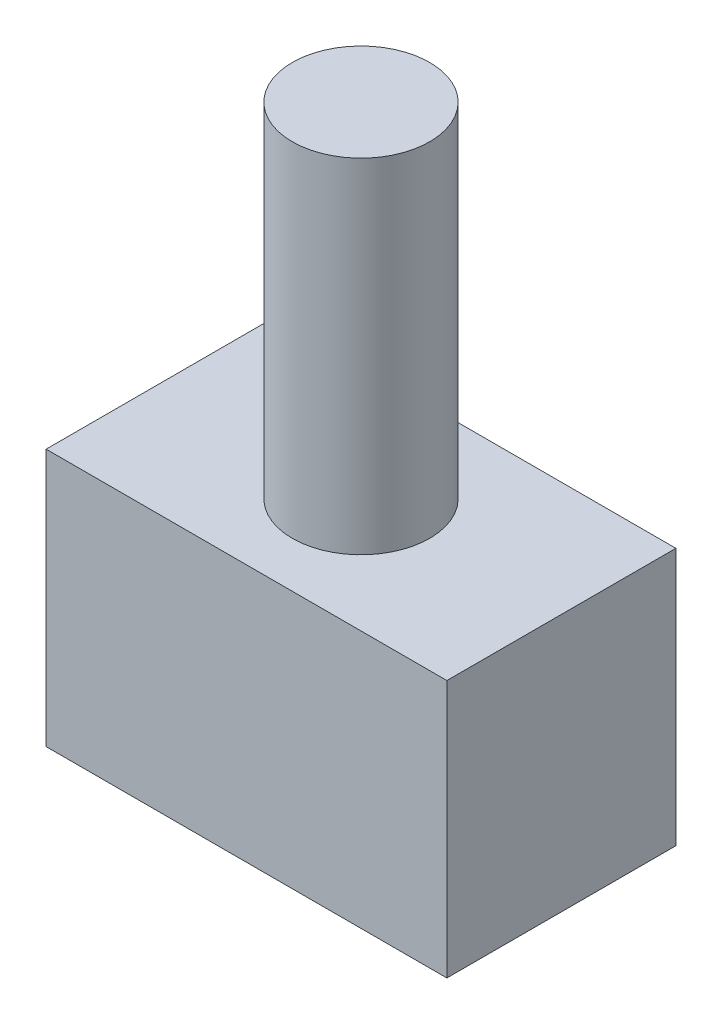
ISO-10303-21;
HEADER;
FILE_DESCRIPTION(('STEP AP214'),'2;1');
FILE_NAME('part.step','',(''),(''),'','','');
FILE_SCHEMA(('AUTOMOTIVE_DESIGN { 1 0 10303 214 1 1 1 1 }'));
ENDSEC;
DATA;
#1=APPLICATION_CONTEXT('core data for automotive mechanical design processes');
#2=APPLICATION_PROTOCOL_DEFINITION('international standard','automotive_design',2000,#1);
#3=PRODUCT_CONTEXT('',#1,'mechanical');
#4=PRODUCT('Part','Part','',(#3));
#5=PRODUCT_RELATED_PRODUCT_CATEGORY('part','',(#4));
#6=PRODUCT_DEFINITION_FORMATION('','',#4);
#7=PRODUCT_DEFINITION_CONTEXT('part definition',#1,'design');
#8=PRODUCT_DEFINITION('design','',#6,#7);
#9=PRODUCT_DEFINITION_SHAPE('','',#8);
#10=(LENGTH_UNIT() NAMED_UNIT(*) SI_UNIT(.MILLI.,.METRE.));
#11=(NAMED_UNIT(*) PLANE_ANGLE_UNIT() SI_UNIT($,.RADIAN.));
#12=(NAMED_UNIT(*) SI_UNIT($,.STERADIAN.) SOLID_ANGLE_UNIT());
#13=UNCERTAINTY_MEASURE_WITH_UNIT(LENGTH_MEASURE(1.E-05),#10,'distance_accuracy_value','');
#14=(GEOMETRIC_REPRESENTATION_CONTEXT(3) GLOBAL_UNCERTAINTY_ASSIGNED_CONTEXT((#13)) GLOBAL_UNIT_ASSIGNED_CONTEXT((#10,
#11,#12)) REPRESENTATION_CONTEXT('',''));
#15=CARTESIAN_POINT('',(0.,0.,0.));
#16=DIRECTION('',(0.,0.,1.));
#17=DIRECTION('',(1.,0.,0.));
#18=AXIS2_PLACEMENT_3D('',#15,#16,#17);
#19=CARTESIAN_POINT('',(0.,0.,0.));
#20=DIRECTION('',(0.,1.,0.));
#21=DIRECTION('',(0.,0.,1.));
#22=AXIS2_PLACEMENT_3D('',#19,#20,#21);
#23=PLANE('',#22);
#24=DIRECTION('',(0.,0.,1.));
#25=VECTOR('',#24,1.);
#26=CARTESIAN_POINT('',(0.,0.,-20.));
#27=LINE('',#26,#25);
#28=CARTESIAN_POINT('',(0.,0.,-20.));
#29=VERTEX_POINT('',#28);
#30=CARTESIAN_POINT('',(0.,0.,0.));
#31=VERTEX_POINT('',#30);
#32=EDGE_CURVE('E97',#29,#31,#27,.T.);
#33=ORIENTED_EDGE('',*,*,#32,.T.);
#34=DIRECTION('',(1.,0.,0.));
#35=VECTOR('',#34,1.);
#36=CARTESIAN_POINT('',(0.,0.,0.));
#37=LINE('',#36,#35);
#38=CARTESIAN_POINT('',(35.,0.,0.));
#39=VERTEX_POINT('',#38);
#40=EDGE_CURVE('E100',#31,#39,#37,.T.);
#41=ORIENTED_EDGE('',*,*,#40,.T.);
#42=DIRECTION('',(0.,0.,-1.));
#43=VECTOR('',#42,1.);
#44=CARTESIAN_POINT('',(35.,0.,-20.));
#45=LINE('',#44,#43);
#46=CARTESIAN_POINT('',(35.,0.,-20.));
#47=VERTEX_POINT('',#46);
#48=EDGE_CURVE('E82',#39,#47,#45,.T.);
#49=ORIENTED_EDGE('',*,*,#48,.T.);
#50=DIRECTION('',(-1.,0.,0.));
#51=VECTOR('',#50,1.);
#52=CARTESIAN_POINT('',(0.,0.,-20.));
#53=LINE('',#52,#51);
#54=EDGE_CURVE('E92',#47,#29,#53,.T.);
#55=ORIENTED_EDGE('',*,*,#54,.T.);
#56=EDGE_LOOP('',(#33,#41,#49,#55));
#57=FACE_BOUND('',#56,.T.);
#58=CARTESIAN_POINT('',(17.5,0.,-10.));
#59=DIRECTION('',(0.,1.,0.));
#60=DIRECTION('',(0.,0.,1.));
#61=AXIS2_PLACEMENT_3D('',#58,#59,#60);
#62=CIRCLE('',#61,6.);
#63=CARTESIAN_POINT('',(17.5,0.,-4.));
#64=VERTEX_POINT('',#63);
#65=EDGE_CURVE('E134',#64,#64,#62,.T.);
#66=ORIENTED_EDGE('',*,*,#65,.F.);
#67=EDGE_LOOP('',(#66));
#68=FACE_BOUND('',#67,.T.);
#69=ADVANCED_FACE('F31',(#57,#68),#23,.T.);
#70=CARTESIAN_POINT('',(0.,-22.5,-20.));
#71=DIRECTION('',(-1.,0.,0.));
#72=DIRECTION('',(0.,0.,1.));
#73=AXIS2_PLACEMENT_3D('',#70,#71,#72);
#74=PLANE('',#73);
#75=ORIENTED_EDGE('',*,*,#32,.F.);
#76=DIRECTION('',(0.,1.,0.));
#77=VECTOR('',#76,1.);
#78=CARTESIAN_POINT('',(0.,-22.5,-20.));
#79=LINE('',#78,#77);
#80=CARTESIAN_POINT('',(0.,-22.5,-20.));
#81=VERTEX_POINT('',#80);
#82=EDGE_CURVE('E11',#81,#29,#79,.T.);
#83=ORIENTED_EDGE('',*,*,#82,.F.);
#84=DIRECTION('',(0.,0.,1.));
#85=VECTOR('',#84,1.);
#86=CARTESIAN_POINT('',(0.,-22.5,-20.));
#87=LINE('',#86,#85);
#88=CARTESIAN_POINT('',(0.,-22.5,0.));
#89=VERTEX_POINT('',#88);
#90=EDGE_CURVE('E90',#81,#89,#87,.T.);
#91=ORIENTED_EDGE('',*,*,#90,.T.);
#92=DIRECTION('',(0.,1.,0.));
#93=VECTOR('',#92,1.);
#94=CARTESIAN_POINT('',(0.,-22.5,0.));
#95=LINE('',#94,#93);
#96=EDGE_CURVE('E35',#89,#31,#95,.T.);
#97=ORIENTED_EDGE('',*,*,#96,.T.);
#98=EDGE_LOOP('',(#75,#83,#91,#97));
#99=FACE_BOUND('',#98,.T.);
#100=ADVANCED_FACE('F33',(#99),#74,.T.);
#101=CARTESIAN_POINT('',(0.,-22.5,-20.));
#102=DIRECTION('',(0.,0.,-1.));
#103=DIRECTION('',(-1.,0.,0.));
#104=AXIS2_PLACEMENT_3D('',#101,#102,#103);
#105=PLANE('',#104);
#106=ORIENTED_EDGE('',*,*,#54,.F.);
#107=DIRECTION('',(0.,1.,0.));
#108=VECTOR('',#107,1.);
#109=CARTESIAN_POINT('',(35.,-22.5,-20.));
#110=LINE('',#109,#108);
#111=CARTESIAN_POINT('',(35.,-22.5,-20.));
#112=VERTEX_POINT('',#111);
#113=EDGE_CURVE('E41',#112,#47,#110,.T.);
#114=ORIENTED_EDGE('',*,*,#113,.F.);
#115=DIRECTION('',(-1.,0.,0.));
#116=VECTOR('',#115,1.);
#117=CARTESIAN_POINT('',(0.,-22.5,-20.));
#118=LINE('',#117,#116);
#119=EDGE_CURVE('E87',#112,#81,#118,.T.);
#120=ORIENTED_EDGE('',*,*,#119,.T.);
#121=ORIENTED_EDGE('',*,*,#82,.T.);
#122=EDGE_LOOP('',(#106,#114,#120,#121));
#123=FACE_BOUND('',#122,.T.);
#124=ADVANCED_FACE('F108',(#123),#105,.T.);
#125=CARTESIAN_POINT('',(35.,-22.5,-20.));
#126=DIRECTION('',(1.,0.,0.));
#127=DIRECTION('',(0.,0.,-1.));
#128=AXIS2_PLACEMENT_3D('',#125,#126,#127);
#129=PLANE('',#128);
#130=ORIENTED_EDGE('',*,*,#48,.F.);
#131=DIRECTION('',(0.,1.,0.));
#132=VECTOR('',#131,1.);
#133=CARTESIAN_POINT('',(35.,-22.5,0.));
#134=LINE('',#133,#132);
#135=CARTESIAN_POINT('',(35.,-22.5,0.));
#136=VERTEX_POINT('',#135);
#137=EDGE_CURVE('E77',#136,#39,#134,.T.);
#138=ORIENTED_EDGE('',*,*,#137,.F.);
#139=DIRECTION('',(0.,0.,-1.));
#140=VECTOR('',#139,1.);
#141=CARTESIAN_POINT('',(35.,-22.5,-20.));
#142=LINE('',#141,#140);
#143=EDGE_CURVE('E80',#136,#112,#142,.T.);
#144=ORIENTED_EDGE('',*,*,#143,.T.);
#145=ORIENTED_EDGE('',*,*,#113,.T.);
#146=EDGE_LOOP('',(#130,#138,#144,#145));
#147=FACE_BOUND('',#146,.T.);
#148=ADVANCED_FACE('F79',(#147),#129,.T.);
#149=CARTESIAN_POINT('',(0.,-22.5,0.));
#150=DIRECTION('',(0.,0.,1.));
#151=DIRECTION('',(1.,0.,0.));
#152=AXIS2_PLACEMENT_3D('',#149,#150,#151);
#153=PLANE('',#152);
#154=ORIENTED_EDGE('',*,*,#40,.F.);
#155=ORIENTED_EDGE('',*,*,#96,.F.);
#156=DIRECTION('',(1.,0.,0.));
#157=VECTOR('',#156,1.);
#158=CARTESIAN_POINT('',(0.,-22.5,0.));
#159=LINE('',#158,#157);
#160=EDGE_CURVE('E86',#89,#136,#159,.T.);
#161=ORIENTED_EDGE('',*,*,#160,.T.);
#162=ORIENTED_EDGE('',*,*,#137,.T.);
#163=EDGE_LOOP('',(#154,#155,#161,#162));
#164=FACE_BOUND('',#163,.T.);
#165=ADVANCED_FACE('F89',(#164),#153,.T.);
#166=CARTESIAN_POINT('',(0.,-22.5,0.));
#167=DIRECTION('',(0.,1.,0.));
#168=DIRECTION('',(0.,0.,1.));
#169=AXIS2_PLACEMENT_3D('',#166,#167,#168);
#170=PLANE('',#169);
#171=ORIENTED_EDGE('',*,*,#90,.F.);
#172=ORIENTED_EDGE('',*,*,#119,.F.);
#173=ORIENTED_EDGE('',*,*,#143,.F.);
#174=ORIENTED_EDGE('',*,*,#160,.F.);
#175=EDGE_LOOP('',(#171,#172,#173,#174));
#176=FACE_BOUND('',#175,.T.);
#177=ADVANCED_FACE('F85',(#176),#170,.F.);
#178=CARTESIAN_POINT('',(17.5,30.,-10.));
#179=DIRECTION('',(0.,-1.,0.));
#180=DIRECTION('',(0.,0.,-1.));
#181=AXIS2_PLACEMENT_3D('',#178,#179,#180);
#182=CYLINDRICAL_SURFACE('',#181,6.);
#183=CARTESIAN_POINT('',(17.5,30.,-10.));
#184=DIRECTION('',(0.,1.,0.));
#185=DIRECTION('',(0.,0.,1.));
#186=AXIS2_PLACEMENT_3D('',#183,#184,#185);
#187=CIRCLE('',#186,6.);
#188=CARTESIAN_POINT('',(17.5,30.,-4.));
#189=VERTEX_POINT('',#188);
#190=EDGE_CURVE('E101',#189,#189,#187,.T.);
#191=ORIENTED_EDGE('',*,*,#190,.F.);
#192=EDGE_LOOP('',(#191));
#193=FACE_BOUND('',#192,.T.);
#194=ORIENTED_EDGE('',*,*,#65,.T.);
#195=EDGE_LOOP('',(#194));
#196=FACE_BOUND('',#195,.T.);
#197=ADVANCED_FACE('F123',(#193,#196),#182,.T.);
#198=CARTESIAN_POINT('',(17.5,30.,-10.));
#199=DIRECTION('',(0.,1.,0.));
#200=DIRECTION('',(0.,0.,1.));
#201=AXIS2_PLACEMENT_3D('',#198,#199,#200);
#202=PLANE('',#201);
#203=ORIENTED_EDGE('',*,*,#190,.T.);
#204=EDGE_LOOP('',(#203));
#205=FACE_BOUND('',#204,.T.);
#206=ADVANCED_FACE('F126',(#205),#202,.T.);
#207=CLOSED_SHELL('',(#69,#100,#124,#148,#165,#177,#197,#206));
#208=MANIFOLD_SOLID_BREP('B2',#207);
#209=ADVANCED_BREP_SHAPE_REPRESENTATION('',(#18,#208),#14);
#210=SHAPE_DEFINITION_REPRESENTATION(#9,#209);
ENDSEC;
END-ISO-10303-21;
